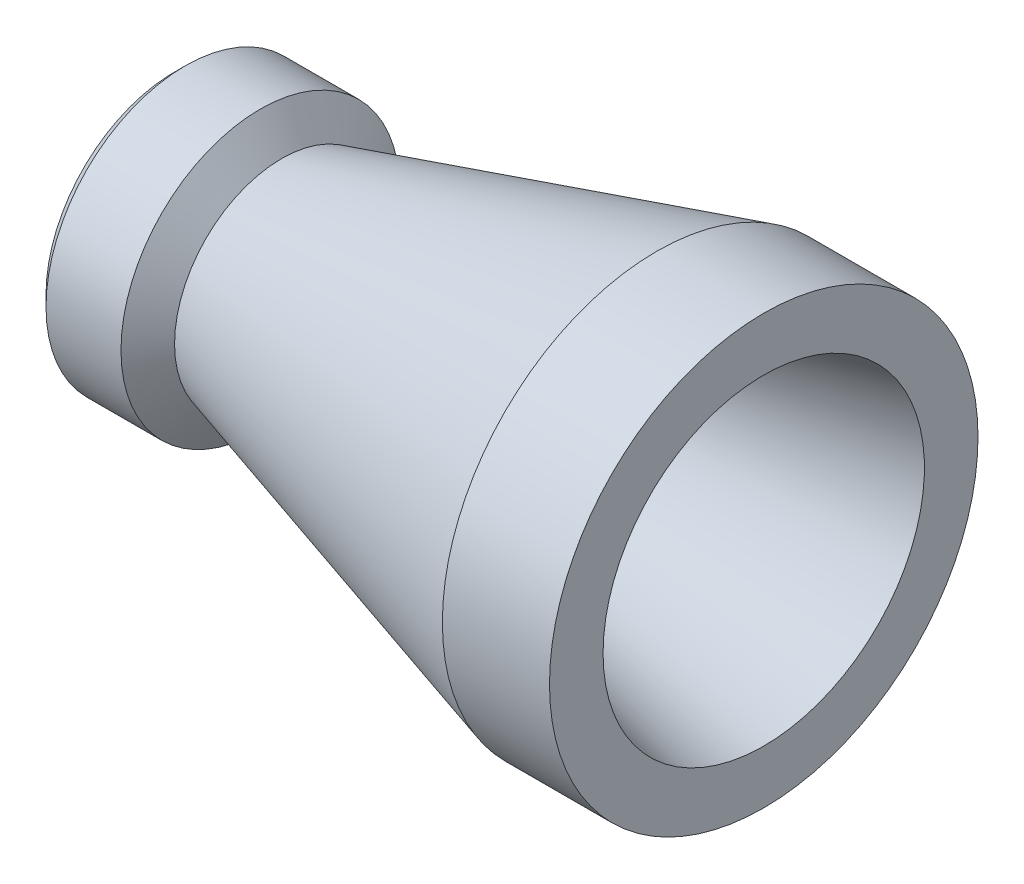
ISO-10303-21;
HEADER;
FILE_DESCRIPTION(('STEP AP214'),'2;1');
FILE_NAME('part.step','',(''),(''),'','','');
FILE_SCHEMA(('AUTOMOTIVE_DESIGN { 1 0 10303 214 1 1 1 1 }'));
ENDSEC;
DATA;
#1=APPLICATION_CONTEXT('core data for automotive mechanical design processes');
#2=APPLICATION_PROTOCOL_DEFINITION('international standard','automotive_design',2000,#1);
#3=PRODUCT_CONTEXT('',#1,'mechanical');
#4=PRODUCT('Part','Part','',(#3));
#5=PRODUCT_RELATED_PRODUCT_CATEGORY('part','',(#4));
#6=PRODUCT_DEFINITION_FORMATION('','',#4);
#7=PRODUCT_DEFINITION_CONTEXT('part definition',#1,'design');
#8=PRODUCT_DEFINITION('design','',#6,#7);
#9=PRODUCT_DEFINITION_SHAPE('','',#8);
#10=(LENGTH_UNIT() NAMED_UNIT(*) SI_UNIT(.MILLI.,.METRE.));
#11=(NAMED_UNIT(*) PLANE_ANGLE_UNIT() SI_UNIT($,.RADIAN.));
#12=(NAMED_UNIT(*) SI_UNIT($,.STERADIAN.) SOLID_ANGLE_UNIT());
#13=UNCERTAINTY_MEASURE_WITH_UNIT(LENGTH_MEASURE(1.E-05),#10,'distance_accuracy_value','');
#14=(GEOMETRIC_REPRESENTATION_CONTEXT(3) GLOBAL_UNCERTAINTY_ASSIGNED_CONTEXT((#13)) GLOBAL_UNIT_ASSIGNED_CONTEXT((#10,
#11,#12)) REPRESENTATION_CONTEXT('',''));
#15=CARTESIAN_POINT('',(0.,0.,0.));
#16=DIRECTION('',(0.,0.,1.));
#17=DIRECTION('',(1.,0.,0.));
#18=AXIS2_PLACEMENT_3D('',#15,#16,#17);
#19=CARTESIAN_POINT('',(23.5567577928221,0.,0.));
#20=DIRECTION('',(1.,0.,0.));
#21=DIRECTION('',(0.,0.,-1.));
#22=AXIS2_PLACEMENT_3D('',#19,#20,#21);
#23=CONICAL_SURFACE('',#22,7.85380858927774,0.223476601140633);
#24=CARTESIAN_POINT('',(55.,0.,0.));
#25=DIRECTION('',(-1.,0.,0.));
#26=DIRECTION('',(0.,0.,1.));
#27=AXIS2_PLACEMENT_3D('',#24,#25,#26);
#28=CIRCLE('',#27,15.);
#29=CARTESIAN_POINT('',(55.,0.,15.));
#30=VERTEX_POINT('',#29);
#31=EDGE_CURVE('E70',#30,#30,#28,.T.);
#32=ORIENTED_EDGE('',*,*,#31,.F.);
#33=EDGE_LOOP('',(#32));
#34=FACE_BOUND('',#33,.T.);
#35=CARTESIAN_POINT('',(23.5567577928221,0.,0.));
#36=DIRECTION('',(-1.,0.,0.));
#37=DIRECTION('',(0.,0.,1.));
#38=AXIS2_PLACEMENT_3D('',#35,#36,#37);
#39=CIRCLE('',#38,7.85380858927774);
#40=CARTESIAN_POINT('',(23.5567577928221,0.,7.85380858927774));
#41=VERTEX_POINT('',#40);
#42=EDGE_CURVE('E10',#41,#41,#39,.T.);
#43=ORIENTED_EDGE('',*,*,#42,.T.);
#44=EDGE_LOOP('',(#43));
#45=FACE_BOUND('',#44,.T.);
#46=ADVANCED_FACE('F33',(#34,#45),#23,.F.);
#47=CARTESIAN_POINT('',(24.,0.,0.));
#48=DIRECTION('',(-1.,0.,0.));
#49=DIRECTION('',(0.,0.,1.));
#50=AXIS2_PLACEMENT_3D('',#47,#48,#49);
#51=TOROIDAL_SURFACE('',#50,5.90354287769482,2.);
#52=ORIENTED_EDGE('',*,*,#42,.F.);
#53=EDGE_LOOP('',(#52));
#54=FACE_BOUND('',#53,.T.);
#55=CARTESIAN_POINT('',(22.,0.,0.));
#56=DIRECTION('',(-1.,0.,0.));
#57=DIRECTION('',(0.,0.,1.));
#58=AXIS2_PLACEMENT_3D('',#55,#56,#57);
#59=CIRCLE('',#58,5.90354287769482);
#60=CARTESIAN_POINT('',(22.,0.,5.90354287769482));
#61=VERTEX_POINT('',#60);
#62=EDGE_CURVE('E39',#61,#61,#59,.T.);
#63=ORIENTED_EDGE('',*,*,#62,.T.);
#64=EDGE_LOOP('',(#63));
#65=FACE_BOUND('',#64,.T.);
#66=ADVANCED_FACE('F77',(#54,#65),#51,.F.);
#67=CARTESIAN_POINT('',(22.,5.90354287769482,0.));
#68=DIRECTION('',(-1.,0.,0.));
#69=DIRECTION('',(0.,0.,1.));
#70=AXIS2_PLACEMENT_3D('',#67,#68,#69);
#71=PLANE('',#70);
#72=ORIENTED_EDGE('',*,*,#62,.F.);
#73=EDGE_LOOP('',(#72));
#74=FACE_BOUND('',#73,.T.);
#75=CARTESIAN_POINT('',(22.,0.,0.));
#76=DIRECTION('',(-1.,0.,0.));
#77=DIRECTION('',(0.,0.,1.));
#78=AXIS2_PLACEMENT_3D('',#75,#76,#77);
#79=CIRCLE('',#78,5.);
#80=CARTESIAN_POINT('',(22.,0.,5.));
#81=VERTEX_POINT('',#80);
#82=EDGE_CURVE('E43',#81,#81,#79,.T.);
#83=ORIENTED_EDGE('',*,*,#82,.T.);
#84=EDGE_LOOP('',(#83));
#85=FACE_BOUND('',#84,.T.);
#86=ADVANCED_FACE('F81',(#74,#85),#71,.F.);
#87=CARTESIAN_POINT('',(0.,0.,0.));
#88=DIRECTION('',(-1.,0.,0.));
#89=DIRECTION('',(0.,0.,1.));
#90=AXIS2_PLACEMENT_3D('',#87,#88,#89);
#91=CYLINDRICAL_SURFACE('',#90,5.);
#92=ORIENTED_EDGE('',*,*,#82,.F.);
#93=EDGE_LOOP('',(#92));
#94=FACE_BOUND('',#93,.T.);
#95=CARTESIAN_POINT('',(0.,0.,0.));
#96=DIRECTION('',(-1.,0.,0.));
#97=DIRECTION('',(0.,0.,1.));
#98=AXIS2_PLACEMENT_3D('',#95,#96,#97);
#99=CIRCLE('',#98,5.);
#100=CARTESIAN_POINT('',(0.,0.,5.));
#101=VERTEX_POINT('',#100);
#102=EDGE_CURVE('E47',#101,#101,#99,.T.);
#103=ORIENTED_EDGE('',*,*,#102,.T.);
#104=EDGE_LOOP('',(#103));
#105=FACE_BOUND('',#104,.T.);
#106=ADVANCED_FACE('F86',(#94,#105),#91,.F.);
#107=CARTESIAN_POINT('',(0.,5.,0.));
#108=DIRECTION('',(1.,0.,0.));
#109=DIRECTION('',(0.,0.,-1.));
#110=AXIS2_PLACEMENT_3D('',#107,#108,#109);
#111=PLANE('',#110);
#112=ORIENTED_EDGE('',*,*,#102,.F.);
#113=EDGE_LOOP('',(#112));
#114=FACE_BOUND('',#113,.T.);
#115=CARTESIAN_POINT('',(0.,0.,0.));
#116=DIRECTION('',(-1.,0.,0.));
#117=DIRECTION('',(0.,0.,1.));
#118=AXIS2_PLACEMENT_3D('',#115,#116,#117);
#119=CIRCLE('',#118,12.);
#120=CARTESIAN_POINT('',(0.,0.,12.));
#121=VERTEX_POINT('',#120);
#122=EDGE_CURVE('E52',#121,#121,#119,.T.);
#123=ORIENTED_EDGE('',*,*,#122,.T.);
#124=EDGE_LOOP('',(#123));
#125=FACE_BOUND('',#124,.T.);
#126=ADVANCED_FACE('F92',(#114,#125),#111,.F.);
#127=CARTESIAN_POINT('',(1.,0.,0.));
#128=DIRECTION('',(1.,0.,0.));
#129=DIRECTION('',(0.,0.,-1.));
#130=AXIS2_PLACEMENT_3D('',#127,#128,#129);
#131=CONICAL_SURFACE('',#130,13.,0.785398163397448);
#132=ORIENTED_EDGE('',*,*,#122,.F.);
#133=EDGE_LOOP('',(#132));
#134=FACE_BOUND('',#133,.T.);
#135=CARTESIAN_POINT('',(1.,0.,0.));
#136=DIRECTION('',(-1.,0.,0.));
#137=DIRECTION('',(0.,0.,1.));
#138=AXIS2_PLACEMENT_3D('',#135,#136,#137);
#139=CIRCLE('',#138,13.);
#140=CARTESIAN_POINT('',(1.,0.,13.));
#141=VERTEX_POINT('',#140);
#142=EDGE_CURVE('E55',#141,#141,#139,.T.);
#143=ORIENTED_EDGE('',*,*,#142,.T.);
#144=EDGE_LOOP('',(#143));
#145=FACE_BOUND('',#144,.T.);
#146=ADVANCED_FACE('F96',(#134,#145),#131,.T.);
#147=CARTESIAN_POINT('',(0.,0.,0.));
#148=DIRECTION('',(-1.,0.,0.));
#149=DIRECTION('',(0.,0.,1.));
#150=AXIS2_PLACEMENT_3D('',#147,#148,#149);
#151=CYLINDRICAL_SURFACE('',#150,13.);
#152=ORIENTED_EDGE('',*,*,#142,.F.);
#153=EDGE_LOOP('',(#152));
#154=FACE_BOUND('',#153,.T.);
#155=CARTESIAN_POINT('',(8.,0.,0.));
#156=DIRECTION('',(-1.,0.,0.));
#157=DIRECTION('',(0.,0.,1.));
#158=AXIS2_PLACEMENT_3D('',#155,#156,#157);
#159=CIRCLE('',#158,13.);
#160=CARTESIAN_POINT('',(8.,0.,13.));
#161=VERTEX_POINT('',#160);
#162=EDGE_CURVE('E58',#161,#161,#159,.T.);
#163=ORIENTED_EDGE('',*,*,#162,.T.);
#164=EDGE_LOOP('',(#163));
#165=FACE_BOUND('',#164,.T.);
#166=ADVANCED_FACE('F100',(#154,#165),#151,.T.);
#167=CARTESIAN_POINT('',(10.,0.,0.));
#168=DIRECTION('',(-1.,0.,0.));
#169=DIRECTION('',(0.,0.,1.));
#170=AXIS2_PLACEMENT_3D('',#167,#168,#169);
#171=CONICAL_SURFACE('',#170,10.,0.982793723247329);
#172=ORIENTED_EDGE('',*,*,#162,.F.);
#173=EDGE_LOOP('',(#172));
#174=FACE_BOUND('',#173,.T.);
#175=CARTESIAN_POINT('',(10.,0.,0.));
#176=DIRECTION('',(-1.,0.,0.));
#177=DIRECTION('',(0.,0.,1.));
#178=AXIS2_PLACEMENT_3D('',#175,#176,#177);
#179=CIRCLE('',#178,10.);
#180=CARTESIAN_POINT('',(10.,0.,10.));
#181=VERTEX_POINT('',#180);
#182=EDGE_CURVE('E61',#181,#181,#179,.T.);
#183=ORIENTED_EDGE('',*,*,#182,.T.);
#184=EDGE_LOOP('',(#183));
#185=FACE_BOUND('',#184,.T.);
#186=ADVANCED_FACE('F104',(#174,#185),#171,.T.);
#187=CARTESIAN_POINT('',(45.,0.,0.));
#188=DIRECTION('',(1.,0.,0.));
#189=DIRECTION('',(0.,0.,-1.));
#190=AXIS2_PLACEMENT_3D('',#187,#188,#189);
#191=CONICAL_SURFACE('',#190,20.,0.278299659005111);
#192=ORIENTED_EDGE('',*,*,#182,.F.);
#193=EDGE_LOOP('',(#192));
#194=FACE_BOUND('',#193,.T.);
#195=CARTESIAN_POINT('',(45.,0.,0.));
#196=DIRECTION('',(-1.,0.,0.));
#197=DIRECTION('',(0.,0.,1.));
#198=AXIS2_PLACEMENT_3D('',#195,#196,#197);
#199=CIRCLE('',#198,20.);
#200=CARTESIAN_POINT('',(45.,0.,20.));
#201=VERTEX_POINT('',#200);
#202=EDGE_CURVE('E64',#201,#201,#199,.T.);
#203=ORIENTED_EDGE('',*,*,#202,.T.);
#204=EDGE_LOOP('',(#203));
#205=FACE_BOUND('',#204,.T.);
#206=ADVANCED_FACE('F108',(#194,#205),#191,.T.);
#207=CARTESIAN_POINT('',(0.,0.,0.));
#208=DIRECTION('',(-1.,0.,0.));
#209=DIRECTION('',(0.,0.,1.));
#210=AXIS2_PLACEMENT_3D('',#207,#208,#209);
#211=CYLINDRICAL_SURFACE('',#210,20.);
#212=ORIENTED_EDGE('',*,*,#202,.F.);
#213=EDGE_LOOP('',(#212));
#214=FACE_BOUND('',#213,.T.);
#215=CARTESIAN_POINT('',(55.,0.,0.));
#216=DIRECTION('',(-1.,0.,0.));
#217=DIRECTION('',(0.,0.,1.));
#218=AXIS2_PLACEMENT_3D('',#215,#216,#217);
#219=CIRCLE('',#218,20.);
#220=CARTESIAN_POINT('',(55.,0.,20.));
#221=VERTEX_POINT('',#220);
#222=EDGE_CURVE('E67',#221,#221,#219,.T.);
#223=ORIENTED_EDGE('',*,*,#222,.T.);
#224=EDGE_LOOP('',(#223));
#225=FACE_BOUND('',#224,.T.);
#226=ADVANCED_FACE('F112',(#214,#225),#211,.T.);
#227=CARTESIAN_POINT('',(55.,20.,0.));
#228=DIRECTION('',(-1.,0.,0.));
#229=DIRECTION('',(0.,0.,1.));
#230=AXIS2_PLACEMENT_3D('',#227,#228,#229);
#231=PLANE('',#230);
#232=ORIENTED_EDGE('',*,*,#222,.F.);
#233=EDGE_LOOP('',(#232));
#234=FACE_BOUND('',#233,.T.);
#235=ORIENTED_EDGE('',*,*,#31,.T.);
#236=EDGE_LOOP('',(#235));
#237=FACE_BOUND('',#236,.T.);
#238=ADVANCED_FACE('F74',(#234,#237),#231,.F.);
#239=CLOSED_SHELL('',(#46,#66,#86,#106,#126,#146,#166,#186,#206,#226,#238));
#240=MANIFOLD_SOLID_BREP('B2',#239);
#241=ADVANCED_BREP_SHAPE_REPRESENTATION('',(#18,#240),#14);
#242=SHAPE_DEFINITION_REPRESENTATION(#9,#241);
ENDSEC;
END-ISO-10303-21;
